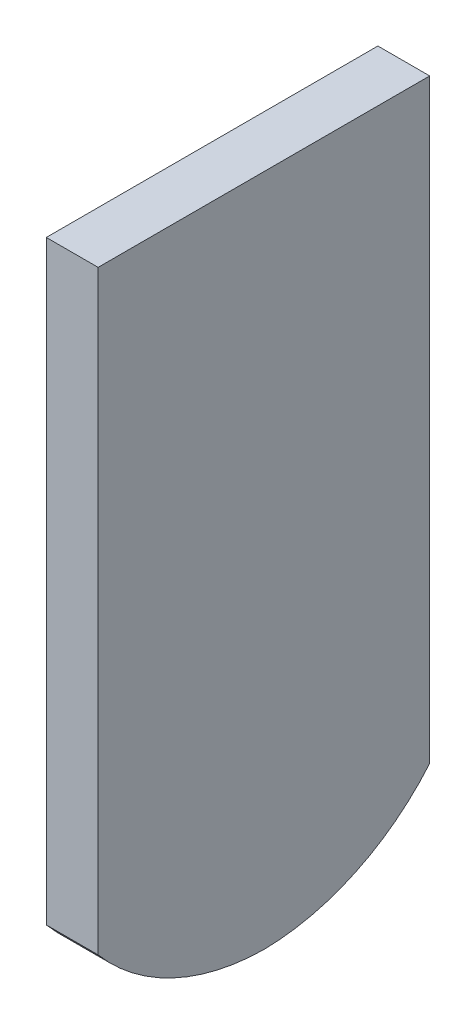
ISO-10303-21;
HEADER;
FILE_DESCRIPTION(('STEP AP214'),'2;1');
FILE_NAME('part.step','',(''),(''),'','','');
FILE_SCHEMA(('AUTOMOTIVE_DESIGN { 1 0 10303 214 1 1 1 1 }'));
ENDSEC;
DATA;
#1=APPLICATION_CONTEXT('core data for automotive mechanical design processes');
#2=APPLICATION_PROTOCOL_DEFINITION('international standard','automotive_design',2000,#1);
#3=PRODUCT_CONTEXT('',#1,'mechanical');
#4=PRODUCT('Part','Part','',(#3));
#5=PRODUCT_RELATED_PRODUCT_CATEGORY('part','',(#4));
#6=PRODUCT_DEFINITION_FORMATION('','',#4);
#7=PRODUCT_DEFINITION_CONTEXT('part definition',#1,'design');
#8=PRODUCT_DEFINITION('design','',#6,#7);
#9=PRODUCT_DEFINITION_SHAPE('','',#8);
#10=(LENGTH_UNIT() NAMED_UNIT(*) SI_UNIT(.MILLI.,.METRE.));
#11=(NAMED_UNIT(*) PLANE_ANGLE_UNIT() SI_UNIT($,.RADIAN.));
#12=(NAMED_UNIT(*) SI_UNIT($,.STERADIAN.) SOLID_ANGLE_UNIT());
#13=UNCERTAINTY_MEASURE_WITH_UNIT(LENGTH_MEASURE(1.E-05),#10,'distance_accuracy_value','');
#14=(GEOMETRIC_REPRESENTATION_CONTEXT(3) GLOBAL_UNCERTAINTY_ASSIGNED_CONTEXT((#13)) GLOBAL_UNIT_ASSIGNED_CONTEXT((#10,
#11,#12)) REPRESENTATION_CONTEXT('',''));
#15=CARTESIAN_POINT('',(0.,0.,0.));
#16=DIRECTION('',(0.,0.,1.));
#17=DIRECTION('',(1.,0.,0.));
#18=AXIS2_PLACEMENT_3D('',#15,#16,#17);
#19=CARTESIAN_POINT('',(-47.975000062,56.813409305375,-30.475));
#20=DIRECTION('',(1.,0.,0.));
#21=DIRECTION('',(0.,0.,-1.));
#22=AXIS2_PLACEMENT_3D('',#19,#20,#21);
#23=PLANE('',#22);
#24=DIRECTION('',(0.,-1.,0.));
#25=VECTOR('',#24,1.);
#26=CARTESIAN_POINT('',(-47.975000062,149.7,-30.475));
#27=LINE('',#26,#25);
#28=CARTESIAN_POINT('',(-47.975000062,140.175,-30.475));
#29=VERTEX_POINT('',#28);
#30=CARTESIAN_POINT('',(-47.975000062,30.7285789436494,-30.475));
#31=VERTEX_POINT('',#30);
#32=EDGE_CURVE('E60',#29,#31,#27,.T.);
#33=ORIENTED_EDGE('',*,*,#32,.F.);
#34=DIRECTION('',(0.,0.,1.));
#35=VECTOR('',#34,1.);
#36=CARTESIAN_POINT('',(-47.975000062,140.175,0.));
#37=LINE('',#36,#35);
#38=CARTESIAN_POINT('',(-47.975000062,140.175,30.475));
#39=VERTEX_POINT('',#38);
#40=EDGE_CURVE('E89',#29,#39,#37,.T.);
#41=ORIENTED_EDGE('',*,*,#40,.T.);
#42=DIRECTION('',(0.,-1.,0.));
#43=VECTOR('',#42,1.);
#44=CARTESIAN_POINT('',(-47.975000062,149.7,30.475));
#45=LINE('',#44,#43);
#46=CARTESIAN_POINT('',(-47.975000062,30.7285789436494,30.475));
#47=VERTEX_POINT('',#46);
#48=EDGE_CURVE('E104',#39,#47,#45,.T.);
#49=ORIENTED_EDGE('',*,*,#48,.T.);
#50=CARTESIAN_POINT('',(-47.975000062,56.813409305375,-0.480000000000008));
#51=DIRECTION('',(1.,0.,0.));
#52=DIRECTION('',(0.,0.,-1.));
#53=AXIS2_PLACEMENT_3D('',#50,#51,#52);
#54=CIRCLE('',#53,40.48);
#55=CARTESIAN_POINT('',(-47.975000062,16.3362552552198,-2.99402429931872E-13));
#56=VERTEX_POINT('',#55);
#57=EDGE_CURVE('E53',#56,#47,#54,.F.);
#58=ORIENTED_EDGE('',*,*,#57,.F.);
#59=CARTESIAN_POINT('',(-47.975000062,56.813409305375,0.479999999999994));
#60=DIRECTION('',(1.,0.,0.));
#61=DIRECTION('',(0.,0.,-1.));
#62=AXIS2_PLACEMENT_3D('',#59,#60,#61);
#63=CIRCLE('',#62,40.48);
#64=EDGE_CURVE('E11',#31,#56,#63,.F.);
#65=ORIENTED_EDGE('',*,*,#64,.F.);
#66=EDGE_LOOP('',(#33,#41,#49,#58,#65));
#67=FACE_BOUND('',#66,.T.);
#68=ADVANCED_FACE('F45',(#67),#23,.T.);
#69=CARTESIAN_POINT('',(-57.500000062,56.813409305375,0.479999999999994));
#70=DIRECTION('',(-1.,0.,0.));
#71=DIRECTION('',(0.,0.,1.));
#72=AXIS2_PLACEMENT_3D('',#69,#70,#71);
#73=CYLINDRICAL_SURFACE('',#72,40.48);
#74=DIRECTION('',(-1.,0.,0.));
#75=VECTOR('',#74,1.);
#76=CARTESIAN_POINT('',(-57.500000062,30.7285789436494,-30.475));
#77=LINE('',#76,#75);
#78=CARTESIAN_POINT('',(-57.500000062,30.7285789436494,-30.475));
#79=VERTEX_POINT('',#78);
#80=EDGE_CURVE('E120',#31,#79,#77,.T.);
#81=ORIENTED_EDGE('',*,*,#80,.F.);
#82=ORIENTED_EDGE('',*,*,#64,.T.);
#83=DIRECTION('',(-1.,0.,0.));
#84=VECTOR('',#83,1.);
#85=CARTESIAN_POINT('',(0.,16.3362552552198,-2.99402429931872E-13));
#86=LINE('',#85,#84);
#87=CARTESIAN_POINT('',(-57.500000062,16.3362552552198,-2.99510850149121E-13));
#88=VERTEX_POINT('',#87);
#89=EDGE_CURVE('E107',#88,#56,#86,.F.);
#90=ORIENTED_EDGE('',*,*,#89,.F.);
#91=CARTESIAN_POINT('',(-57.500000062,56.813409305375,0.479999999999994));
#92=DIRECTION('',(1.,0.,0.));
#93=DIRECTION('',(0.,0.,-1.));
#94=AXIS2_PLACEMENT_3D('',#91,#92,#93);
#95=CIRCLE('',#94,40.48);
#96=EDGE_CURVE('E115',#79,#88,#95,.F.);
#97=ORIENTED_EDGE('',*,*,#96,.F.);
#98=EDGE_LOOP('',(#81,#82,#90,#97));
#99=FACE_BOUND('',#98,.T.);
#100=ADVANCED_FACE('F137',(#99),#73,.T.);
#101=CARTESIAN_POINT('',(47.975000062,140.175,-30.475));
#102=DIRECTION('',(0.,0.,1.));
#103=DIRECTION('',(1.,0.,0.));
#104=AXIS2_PLACEMENT_3D('',#101,#102,#103);
#105=PLANE('',#104);
#106=ORIENTED_EDGE('',*,*,#32,.T.);
#107=ORIENTED_EDGE('',*,*,#80,.T.);
#108=DIRECTION('',(0.,1.,0.));
#109=VECTOR('',#108,1.);
#110=CARTESIAN_POINT('',(-57.500000062,16.3362552552198,-30.475));
#111=LINE('',#110,#109);
#112=CARTESIAN_POINT('',(-57.500000062,140.175,-30.475));
#113=VERTEX_POINT('',#112);
#114=EDGE_CURVE('E97',#79,#113,#111,.T.);
#115=ORIENTED_EDGE('',*,*,#114,.T.);
#116=DIRECTION('',(-1.,0.,0.));
#117=VECTOR('',#116,1.);
#118=CARTESIAN_POINT('',(47.975000062,140.175,-30.475));
#119=LINE('',#118,#117);
#120=EDGE_CURVE('E94',#29,#113,#119,.T.);
#121=ORIENTED_EDGE('',*,*,#120,.F.);
#122=EDGE_LOOP('',(#106,#107,#115,#121));
#123=FACE_BOUND('',#122,.T.);
#124=ADVANCED_FACE('F95',(#123),#105,.F.);
#125=CARTESIAN_POINT('',(-57.500000062,56.813409305375,-0.480000000000008));
#126=DIRECTION('',(-1.,0.,0.));
#127=DIRECTION('',(0.,0.,1.));
#128=AXIS2_PLACEMENT_3D('',#125,#126,#127);
#129=CYLINDRICAL_SURFACE('',#128,40.48);
#130=ORIENTED_EDGE('',*,*,#89,.T.);
#131=ORIENTED_EDGE('',*,*,#57,.T.);
#132=DIRECTION('',(-1.,0.,0.));
#133=VECTOR('',#132,1.);
#134=CARTESIAN_POINT('',(-57.500000062,30.7285789436494,30.475));
#135=LINE('',#134,#133);
#136=CARTESIAN_POINT('',(-57.500000062,30.7285789436494,30.475));
#137=VERTEX_POINT('',#136);
#138=EDGE_CURVE('E91',#137,#47,#135,.F.);
#139=ORIENTED_EDGE('',*,*,#138,.F.);
#140=CARTESIAN_POINT('',(-57.500000062,56.813409305375,-0.480000000000008));
#141=DIRECTION('',(1.,0.,0.));
#142=DIRECTION('',(0.,0.,-1.));
#143=AXIS2_PLACEMENT_3D('',#140,#141,#142);
#144=CIRCLE('',#143,40.48);
#145=EDGE_CURVE('E112',#88,#137,#144,.F.);
#146=ORIENTED_EDGE('',*,*,#145,.F.);
#147=EDGE_LOOP('',(#130,#131,#139,#146));
#148=FACE_BOUND('',#147,.T.);
#149=ADVANCED_FACE('F127',(#148),#129,.T.);
#150=CARTESIAN_POINT('',(-57.500000062,16.3362552552198,-2.99510850149121E-13));
#151=DIRECTION('',(-1.,0.,0.));
#152=DIRECTION('',(0.,0.,1.));
#153=AXIS2_PLACEMENT_3D('',#150,#151,#152);
#154=PLANE('',#153);
#155=ORIENTED_EDGE('',*,*,#114,.F.);
#156=ORIENTED_EDGE('',*,*,#96,.T.);
#157=ORIENTED_EDGE('',*,*,#145,.T.);
#158=DIRECTION('',(0.,-1.,0.));
#159=VECTOR('',#158,1.);
#160=CARTESIAN_POINT('',(-57.500000062,16.3362552552198,30.475));
#161=LINE('',#160,#159);
#162=CARTESIAN_POINT('',(-57.500000062,140.175,30.475));
#163=VERTEX_POINT('',#162);
#164=EDGE_CURVE('E119',#163,#137,#161,.T.);
#165=ORIENTED_EDGE('',*,*,#164,.F.);
#166=DIRECTION('',(0.,0.,1.));
#167=VECTOR('',#166,1.);
#168=CARTESIAN_POINT('',(-57.500000062,140.175,-2.99510850149121E-13));
#169=LINE('',#168,#167);
#170=EDGE_CURVE('E105',#113,#163,#169,.T.);
#171=ORIENTED_EDGE('',*,*,#170,.F.);
#172=EDGE_LOOP('',(#155,#156,#157,#165,#171));
#173=FACE_BOUND('',#172,.T.);
#174=ADVANCED_FACE('F134',(#173),#154,.T.);
#175=CARTESIAN_POINT('',(47.975000062,140.175,30.475));
#176=DIRECTION('',(0.,-1.,0.));
#177=DIRECTION('',(0.,0.,-1.));
#178=AXIS2_PLACEMENT_3D('',#175,#176,#177);
#179=PLANE('',#178);
#180=ORIENTED_EDGE('',*,*,#40,.F.);
#181=ORIENTED_EDGE('',*,*,#120,.T.);
#182=ORIENTED_EDGE('',*,*,#170,.T.);
#183=DIRECTION('',(1.,0.,0.));
#184=VECTOR('',#183,1.);
#185=CARTESIAN_POINT('',(47.975000062,140.175,30.475));
#186=LINE('',#185,#184);
#187=EDGE_CURVE('E101',#163,#39,#186,.T.);
#188=ORIENTED_EDGE('',*,*,#187,.T.);
#189=EDGE_LOOP('',(#180,#181,#182,#188));
#190=FACE_BOUND('',#189,.T.);
#191=ADVANCED_FACE('F47',(#190),#179,.F.);
#192=CARTESIAN_POINT('',(-47.975000062,140.175,30.475));
#193=DIRECTION('',(0.,0.,-1.));
#194=DIRECTION('',(-1.,0.,0.));
#195=AXIS2_PLACEMENT_3D('',#192,#193,#194);
#196=PLANE('',#195);
#197=ORIENTED_EDGE('',*,*,#138,.T.);
#198=ORIENTED_EDGE('',*,*,#48,.F.);
#199=ORIENTED_EDGE('',*,*,#187,.F.);
#200=ORIENTED_EDGE('',*,*,#164,.T.);
#201=EDGE_LOOP('',(#197,#198,#199,#200));
#202=FACE_BOUND('',#201,.T.);
#203=ADVANCED_FACE('F131',(#202),#196,.F.);
#204=CLOSED_SHELL('',(#68,#100,#124,#149,#174,#191,#203));
#205=MANIFOLD_SOLID_BREP('B2',#204);
#206=ADVANCED_BREP_SHAPE_REPRESENTATION('',(#18,#205),#14);
#207=SHAPE_DEFINITION_REPRESENTATION(#9,#206);
ENDSEC;
END-ISO-10303-21;
